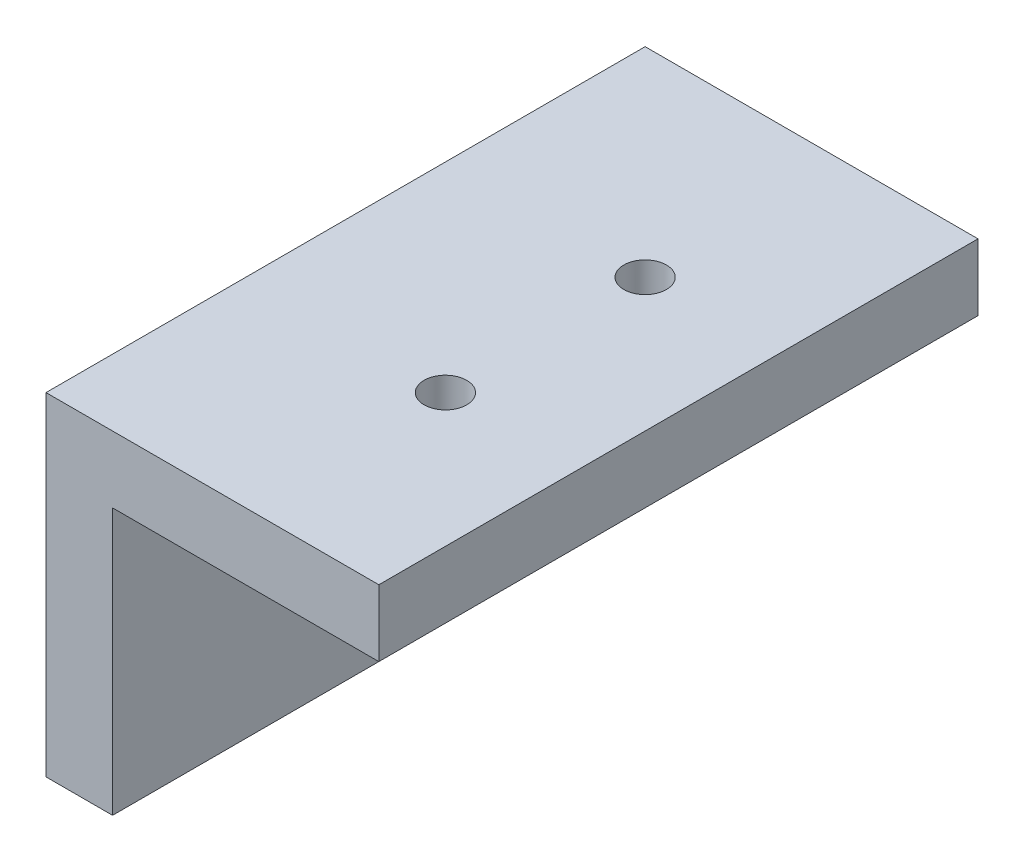
ISO-10303-21;
HEADER;
FILE_DESCRIPTION(('STEP AP214'),'2;1');
FILE_NAME('part.step','',(''),(''),'','','');
FILE_SCHEMA(('AUTOMOTIVE_DESIGN { 1 0 10303 214 1 1 1 1 }'));
ENDSEC;
DATA;
#1=APPLICATION_CONTEXT('core data for automotive mechanical design processes');
#2=APPLICATION_PROTOCOL_DEFINITION('international standard','automotive_design',2000,#1);
#3=PRODUCT_CONTEXT('',#1,'mechanical');
#4=PRODUCT('Part','Part','',(#3));
#5=PRODUCT_RELATED_PRODUCT_CATEGORY('part','',(#4));
#6=PRODUCT_DEFINITION_FORMATION('','',#4);
#7=PRODUCT_DEFINITION_CONTEXT('part definition',#1,'design');
#8=PRODUCT_DEFINITION('design','',#6,#7);
#9=PRODUCT_DEFINITION_SHAPE('','',#8);
#10=(LENGTH_UNIT() NAMED_UNIT(*) SI_UNIT(.MILLI.,.METRE.));
#11=(NAMED_UNIT(*) PLANE_ANGLE_UNIT() SI_UNIT($,.RADIAN.));
#12=(NAMED_UNIT(*) SI_UNIT($,.STERADIAN.) SOLID_ANGLE_UNIT());
#13=UNCERTAINTY_MEASURE_WITH_UNIT(LENGTH_MEASURE(1.E-05),#10,'distance_accuracy_value','');
#14=(GEOMETRIC_REPRESENTATION_CONTEXT(3) GLOBAL_UNCERTAINTY_ASSIGNED_CONTEXT((#13)) GLOBAL_UNIT_ASSIGNED_CONTEXT((#10,
#11,#12)) REPRESENTATION_CONTEXT('',''));
#15=CARTESIAN_POINT('',(0.,0.,0.));
#16=DIRECTION('',(0.,0.,1.));
#17=DIRECTION('',(1.,0.,0.));
#18=AXIS2_PLACEMENT_3D('',#15,#16,#17);
#19=CARTESIAN_POINT('',(-5.001,-10.,15.));
#20=DIRECTION('',(1.,0.,0.));
#21=DIRECTION('',(0.,1.,0.));
#22=AXIS2_PLACEMENT_3D('',#19,#20,#21);
#23=CYLINDRICAL_SURFACE('',#22,1.6);
#24=CARTESIAN_POINT('',(-5.,-10.,15.));
#25=DIRECTION('',(1.,0.,0.));
#26=DIRECTION('',(0.,1.,0.));
#27=AXIS2_PLACEMENT_3D('',#24,#25,#26);
#28=CIRCLE('',#27,1.6);
#29=CARTESIAN_POINT('',(-5.,-8.4,15.));
#30=VERTEX_POINT('',#29);
#31=EDGE_CURVE('E170',#30,#30,#28,.F.);
#32=ORIENTED_EDGE('',*,*,#31,.T.);
#33=EDGE_LOOP('',(#32));
#34=FACE_BOUND('',#33,.T.);
#35=CARTESIAN_POINT('',(-3.75,-10.,15.));
#36=DIRECTION('',(1.,0.,0.));
#37=DIRECTION('',(0.,1.,0.));
#38=AXIS2_PLACEMENT_3D('',#35,#36,#37);
#39=CIRCLE('',#38,1.6);
#40=CARTESIAN_POINT('',(-3.75,-8.4,15.));
#41=VERTEX_POINT('',#40);
#42=EDGE_CURVE('E37',#41,#41,#39,.F.);
#43=ORIENTED_EDGE('',*,*,#42,.F.);
#44=EDGE_LOOP('',(#43));
#45=FACE_BOUND('',#44,.T.);
#46=ADVANCED_FACE('F33',(#34,#45),#23,.F.);
#47=CARTESIAN_POINT('',(-5.001,-10.,30.));
#48=DIRECTION('',(1.,0.,0.));
#49=DIRECTION('',(0.,1.,0.));
#50=AXIS2_PLACEMENT_3D('',#47,#48,#49);
#51=CYLINDRICAL_SURFACE('',#50,1.6);
#52=CARTESIAN_POINT('',(-5.,-10.,30.));
#53=DIRECTION('',(1.,0.,0.));
#54=DIRECTION('',(0.,1.,0.));
#55=AXIS2_PLACEMENT_3D('',#52,#53,#54);
#56=CIRCLE('',#55,1.6);
#57=CARTESIAN_POINT('',(-5.,-8.4,30.));
#58=VERTEX_POINT('',#57);
#59=EDGE_CURVE('E128',#58,#58,#56,.F.);
#60=ORIENTED_EDGE('',*,*,#59,.T.);
#61=EDGE_LOOP('',(#60));
#62=FACE_BOUND('',#61,.T.);
#63=CARTESIAN_POINT('',(-3.75,-10.,30.));
#64=DIRECTION('',(1.,0.,0.));
#65=DIRECTION('',(0.,1.,0.));
#66=AXIS2_PLACEMENT_3D('',#63,#64,#65);
#67=CIRCLE('',#66,1.6);
#68=CARTESIAN_POINT('',(-3.75,-8.4,30.));
#69=VERTEX_POINT('',#68);
#70=EDGE_CURVE('E144',#69,#69,#67,.F.);
#71=ORIENTED_EDGE('',*,*,#70,.F.);
#72=EDGE_LOOP('',(#71));
#73=FACE_BOUND('',#72,.T.);
#74=ADVANCED_FACE('F205',(#62,#73),#51,.F.);
#75=CARTESIAN_POINT('',(0.,0.,45.));
#76=DIRECTION('',(0.,1.,0.));
#77=DIRECTION('',(0.,0.,1.));
#78=AXIS2_PLACEMENT_3D('',#75,#76,#77);
#79=PLANE('',#78);
#80=CARTESIAN_POINT('',(10.,0.,30.));
#81=DIRECTION('',(0.,-1.,0.));
#82=DIRECTION('',(0.,0.,-1.));
#83=AXIS2_PLACEMENT_3D('',#80,#81,#82);
#84=CIRCLE('',#83,1.6);
#85=CARTESIAN_POINT('',(10.,0.,28.4));
#86=VERTEX_POINT('',#85);
#87=EDGE_CURVE('E161',#86,#86,#84,.T.);
#88=ORIENTED_EDGE('',*,*,#87,.F.);
#89=EDGE_LOOP('',(#88));
#90=FACE_BOUND('',#89,.T.);
#91=CARTESIAN_POINT('',(10.,0.,15.));
#92=DIRECTION('',(0.,-1.,0.));
#93=DIRECTION('',(0.,0.,-1.));
#94=AXIS2_PLACEMENT_3D('',#91,#92,#93);
#95=CIRCLE('',#94,1.6);
#96=CARTESIAN_POINT('',(10.,0.,13.4));
#97=VERTEX_POINT('',#96);
#98=EDGE_CURVE('E152',#97,#97,#95,.T.);
#99=ORIENTED_EDGE('',*,*,#98,.F.);
#100=EDGE_LOOP('',(#99));
#101=FACE_BOUND('',#100,.T.);
#102=DIRECTION('',(1.,0.,0.));
#103=VECTOR('',#102,1.);
#104=CARTESIAN_POINT('',(0.,0.,0.));
#105=LINE('',#104,#103);
#106=CARTESIAN_POINT('',(0.,0.,0.));
#107=VERTEX_POINT('',#106);
#108=CARTESIAN_POINT('',(20.,0.,0.));
#109=VERTEX_POINT('',#108);
#110=EDGE_CURVE('E124',#107,#109,#105,.T.);
#111=ORIENTED_EDGE('',*,*,#110,.T.);
#112=DIRECTION('',(0.,0.,-1.));
#113=VECTOR('',#112,1.);
#114=CARTESIAN_POINT('',(20.,0.,45.));
#115=LINE('',#114,#113);
#116=CARTESIAN_POINT('',(20.,0.,45.));
#117=VERTEX_POINT('',#116);
#118=EDGE_CURVE('E11',#117,#109,#115,.T.);
#119=ORIENTED_EDGE('',*,*,#118,.F.);
#120=DIRECTION('',(1.,0.,0.));
#121=VECTOR('',#120,1.);
#122=CARTESIAN_POINT('',(0.,0.,45.));
#123=LINE('',#122,#121);
#124=CARTESIAN_POINT('',(0.,0.,45.));
#125=VERTEX_POINT('',#124);
#126=EDGE_CURVE('E135',#125,#117,#123,.T.);
#127=ORIENTED_EDGE('',*,*,#126,.F.);
#128=DIRECTION('',(0.,0.,-1.));
#129=VECTOR('',#128,1.);
#130=CARTESIAN_POINT('',(0.,0.,45.));
#131=LINE('',#130,#129);
#132=EDGE_CURVE('E120',#125,#107,#131,.T.);
#133=ORIENTED_EDGE('',*,*,#132,.T.);
#134=EDGE_LOOP('',(#111,#119,#127,#133));
#135=FACE_BOUND('',#134,.T.);
#136=ADVANCED_FACE('F35',(#90,#101,#135),#79,.F.);
#137=CARTESIAN_POINT('',(20.,0.,45.));
#138=DIRECTION('',(-1.,0.,0.));
#139=DIRECTION('',(0.,0.,1.));
#140=AXIS2_PLACEMENT_3D('',#137,#138,#139);
#141=PLANE('',#140);
#142=DIRECTION('',(0.,1.,0.));
#143=VECTOR('',#142,1.);
#144=CARTESIAN_POINT('',(20.,0.,0.));
#145=LINE('',#144,#143);
#146=CARTESIAN_POINT('',(20.,5.,0.));
#147=VERTEX_POINT('',#146);
#148=EDGE_CURVE('E127',#109,#147,#145,.T.);
#149=ORIENTED_EDGE('',*,*,#148,.T.);
#150=DIRECTION('',(0.,0.,-1.));
#151=VECTOR('',#150,1.);
#152=CARTESIAN_POINT('',(20.,5.,45.));
#153=LINE('',#152,#151);
#154=CARTESIAN_POINT('',(20.,5.,45.));
#155=VERTEX_POINT('',#154);
#156=EDGE_CURVE('E43',#155,#147,#153,.T.);
#157=ORIENTED_EDGE('',*,*,#156,.F.);
#158=DIRECTION('',(0.,1.,0.));
#159=VECTOR('',#158,1.);
#160=CARTESIAN_POINT('',(20.,0.,45.));
#161=LINE('',#160,#159);
#162=EDGE_CURVE('E90',#117,#155,#161,.T.);
#163=ORIENTED_EDGE('',*,*,#162,.F.);
#164=ORIENTED_EDGE('',*,*,#118,.T.);
#165=EDGE_LOOP('',(#149,#157,#163,#164));
#166=FACE_BOUND('',#165,.T.);
#167=ADVANCED_FACE('F181',(#166),#141,.F.);
#168=CARTESIAN_POINT('',(20.,5.,45.));
#169=DIRECTION('',(0.,-1.,0.));
#170=DIRECTION('',(1.,0.,0.));
#171=AXIS2_PLACEMENT_3D('',#168,#169,#170);
#172=PLANE('',#171);
#173=CARTESIAN_POINT('',(10.,5.,30.));
#174=DIRECTION('',(0.,-1.,0.));
#175=DIRECTION('',(1.,0.,0.));
#176=AXIS2_PLACEMENT_3D('',#173,#174,#175);
#177=CIRCLE('',#176,1.6);
#178=CARTESIAN_POINT('',(11.6,5.,30.));
#179=VERTEX_POINT('',#178);
#180=EDGE_CURVE('E164',#179,#179,#177,.F.);
#181=ORIENTED_EDGE('',*,*,#180,.F.);
#182=EDGE_LOOP('',(#181));
#183=FACE_BOUND('',#182,.T.);
#184=CARTESIAN_POINT('',(10.,5.,15.));
#185=DIRECTION('',(0.,-1.,0.));
#186=DIRECTION('',(1.,0.,0.));
#187=AXIS2_PLACEMENT_3D('',#184,#185,#186);
#188=CIRCLE('',#187,1.6);
#189=CARTESIAN_POINT('',(11.6,5.,15.));
#190=VERTEX_POINT('',#189);
#191=EDGE_CURVE('E156',#190,#190,#188,.F.);
#192=ORIENTED_EDGE('',*,*,#191,.F.);
#193=EDGE_LOOP('',(#192));
#194=FACE_BOUND('',#193,.T.);
#195=DIRECTION('',(-1.,0.,0.));
#196=VECTOR('',#195,1.);
#197=CARTESIAN_POINT('',(20.,5.,0.));
#198=LINE('',#197,#196);
#199=CARTESIAN_POINT('',(-5.,5.,0.));
#200=VERTEX_POINT('',#199);
#201=EDGE_CURVE('E130',#147,#200,#198,.T.);
#202=ORIENTED_EDGE('',*,*,#201,.T.);
#203=DIRECTION('',(0.,0.,-1.));
#204=VECTOR('',#203,1.);
#205=CARTESIAN_POINT('',(-5.,5.,45.));
#206=LINE('',#205,#204);
#207=CARTESIAN_POINT('',(-5.,5.,45.));
#208=VERTEX_POINT('',#207);
#209=EDGE_CURVE('E115',#208,#200,#206,.T.);
#210=ORIENTED_EDGE('',*,*,#209,.F.);
#211=DIRECTION('',(-1.,0.,0.));
#212=VECTOR('',#211,1.);
#213=CARTESIAN_POINT('',(20.,5.,45.));
#214=LINE('',#213,#212);
#215=EDGE_CURVE('E106',#155,#208,#214,.T.);
#216=ORIENTED_EDGE('',*,*,#215,.F.);
#217=ORIENTED_EDGE('',*,*,#156,.T.);
#218=EDGE_LOOP('',(#202,#210,#216,#217));
#219=FACE_BOUND('',#218,.T.);
#220=ADVANCED_FACE('F184',(#183,#194,#219),#172,.F.);
#221=CARTESIAN_POINT('',(-5.,5.,45.));
#222=DIRECTION('',(1.,0.,0.));
#223=DIRECTION('',(0.,1.,0.));
#224=AXIS2_PLACEMENT_3D('',#221,#222,#223);
#225=PLANE('',#224);
#226=ORIENTED_EDGE('',*,*,#59,.F.);
#227=EDGE_LOOP('',(#226));
#228=FACE_BOUND('',#227,.T.);
#229=ORIENTED_EDGE('',*,*,#31,.F.);
#230=EDGE_LOOP('',(#229));
#231=FACE_BOUND('',#230,.T.);
#232=DIRECTION('',(0.,-1.,0.));
#233=VECTOR('',#232,1.);
#234=CARTESIAN_POINT('',(-5.,5.,0.));
#235=LINE('',#234,#233);
#236=CARTESIAN_POINT('',(-5.,-20.,0.));
#237=VERTEX_POINT('',#236);
#238=EDGE_CURVE('E114',#200,#237,#235,.T.);
#239=ORIENTED_EDGE('',*,*,#238,.T.);
#240=DIRECTION('',(0.,0.,-1.));
#241=VECTOR('',#240,1.);
#242=CARTESIAN_POINT('',(-5.,-20.,45.));
#243=LINE('',#242,#241);
#244=CARTESIAN_POINT('',(-5.,-20.,45.));
#245=VERTEX_POINT('',#244);
#246=EDGE_CURVE('E111',#245,#237,#243,.T.);
#247=ORIENTED_EDGE('',*,*,#246,.F.);
#248=DIRECTION('',(0.,-1.,0.));
#249=VECTOR('',#248,1.);
#250=CARTESIAN_POINT('',(-5.,5.,45.));
#251=LINE('',#250,#249);
#252=EDGE_CURVE('E100',#208,#245,#251,.T.);
#253=ORIENTED_EDGE('',*,*,#252,.F.);
#254=ORIENTED_EDGE('',*,*,#209,.T.);
#255=EDGE_LOOP('',(#239,#247,#253,#254));
#256=FACE_BOUND('',#255,.T.);
#257=ADVANCED_FACE('F112',(#228,#231,#256),#225,.F.);
#258=CARTESIAN_POINT('',(-5.,-20.,45.));
#259=DIRECTION('',(0.,1.,0.));
#260=DIRECTION('',(-1.,0.,0.));
#261=AXIS2_PLACEMENT_3D('',#258,#259,#260);
#262=PLANE('',#261);
#263=DIRECTION('',(1.,0.,0.));
#264=VECTOR('',#263,1.);
#265=CARTESIAN_POINT('',(-5.,-20.,0.));
#266=LINE('',#265,#264);
#267=CARTESIAN_POINT('',(0.,-20.,0.));
#268=VERTEX_POINT('',#267);
#269=EDGE_CURVE('E76',#237,#268,#266,.T.);
#270=ORIENTED_EDGE('',*,*,#269,.T.);
#271=DIRECTION('',(0.,0.,-1.));
#272=VECTOR('',#271,1.);
#273=CARTESIAN_POINT('',(0.,-20.,45.));
#274=LINE('',#273,#272);
#275=CARTESIAN_POINT('',(0.,-20.,45.));
#276=VERTEX_POINT('',#275);
#277=EDGE_CURVE('E116',#276,#268,#274,.T.);
#278=ORIENTED_EDGE('',*,*,#277,.F.);
#279=DIRECTION('',(1.,0.,0.));
#280=VECTOR('',#279,1.);
#281=CARTESIAN_POINT('',(-5.,-20.,45.));
#282=LINE('',#281,#280);
#283=EDGE_CURVE('E104',#245,#276,#282,.T.);
#284=ORIENTED_EDGE('',*,*,#283,.F.);
#285=ORIENTED_EDGE('',*,*,#246,.T.);
#286=EDGE_LOOP('',(#270,#278,#284,#285));
#287=FACE_BOUND('',#286,.T.);
#288=ADVANCED_FACE('F118',(#287),#262,.F.);
#289=CARTESIAN_POINT('',(0.,0.,45.));
#290=DIRECTION('',(-1.,0.,0.));
#291=DIRECTION('',(0.,-1.,0.));
#292=AXIS2_PLACEMENT_3D('',#289,#290,#291);
#293=PLANE('',#292);
#294=CARTESIAN_POINT('',(0.,-10.,30.));
#295=DIRECTION('',(1.,0.,0.));
#296=DIRECTION('',(0.,1.,0.));
#297=AXIS2_PLACEMENT_3D('',#294,#295,#296);
#298=CIRCLE('',#297,1.6);
#299=CARTESIAN_POINT('',(0.,-8.4,30.));
#300=VERTEX_POINT('',#299);
#301=EDGE_CURVE('E167',#300,#300,#298,.T.);
#302=ORIENTED_EDGE('',*,*,#301,.F.);
#303=EDGE_LOOP('',(#302));
#304=FACE_BOUND('',#303,.T.);
#305=CARTESIAN_POINT('',(0.,-10.,15.));
#306=DIRECTION('',(1.,0.,0.));
#307=DIRECTION('',(0.,1.,0.));
#308=AXIS2_PLACEMENT_3D('',#305,#306,#307);
#309=CIRCLE('',#308,1.6);
#310=CARTESIAN_POINT('',(0.,-8.4,15.));
#311=VERTEX_POINT('',#310);
#312=EDGE_CURVE('E173',#311,#311,#309,.T.);
#313=ORIENTED_EDGE('',*,*,#312,.F.);
#314=EDGE_LOOP('',(#313));
#315=FACE_BOUND('',#314,.T.);
#316=DIRECTION('',(0.,1.,0.));
#317=VECTOR('',#316,1.);
#318=CARTESIAN_POINT('',(0.,0.,0.));
#319=LINE('',#318,#317);
#320=EDGE_CURVE('E82',#268,#107,#319,.T.);
#321=ORIENTED_EDGE('',*,*,#320,.T.);
#322=ORIENTED_EDGE('',*,*,#132,.F.);
#323=DIRECTION('',(0.,1.,0.));
#324=VECTOR('',#323,1.);
#325=CARTESIAN_POINT('',(0.,0.,45.));
#326=LINE('',#325,#324);
#327=EDGE_CURVE('E52',#276,#125,#326,.T.);
#328=ORIENTED_EDGE('',*,*,#327,.F.);
#329=ORIENTED_EDGE('',*,*,#277,.T.);
#330=EDGE_LOOP('',(#321,#322,#328,#329));
#331=FACE_BOUND('',#330,.T.);
#332=ADVANCED_FACE('F189',(#304,#315,#331),#293,.F.);
#333=CARTESIAN_POINT('',(0.,0.,45.));
#334=DIRECTION('',(0.,0.,1.));
#335=DIRECTION('',(1.,0.,0.));
#336=AXIS2_PLACEMENT_3D('',#333,#334,#335);
#337=PLANE('',#336);
#338=ORIENTED_EDGE('',*,*,#126,.T.);
#339=ORIENTED_EDGE('',*,*,#162,.T.);
#340=ORIENTED_EDGE('',*,*,#215,.T.);
#341=ORIENTED_EDGE('',*,*,#252,.T.);
#342=ORIENTED_EDGE('',*,*,#283,.T.);
#343=ORIENTED_EDGE('',*,*,#327,.T.);
#344=EDGE_LOOP('',(#338,#339,#340,#341,#342,#343));
#345=FACE_BOUND('',#344,.T.);
#346=ADVANCED_FACE('F102',(#345),#337,.T.);
#347=CARTESIAN_POINT('',(0.,0.,0.));
#348=DIRECTION('',(0.,0.,1.));
#349=DIRECTION('',(1.,0.,0.));
#350=AXIS2_PLACEMENT_3D('',#347,#348,#349);
#351=PLANE('',#350);
#352=ORIENTED_EDGE('',*,*,#110,.F.);
#353=ORIENTED_EDGE('',*,*,#320,.F.);
#354=ORIENTED_EDGE('',*,*,#269,.F.);
#355=ORIENTED_EDGE('',*,*,#238,.F.);
#356=ORIENTED_EDGE('',*,*,#201,.F.);
#357=ORIENTED_EDGE('',*,*,#148,.F.);
#358=EDGE_LOOP('',(#352,#353,#354,#355,#356,#357));
#359=FACE_BOUND('',#358,.T.);
#360=ADVANCED_FACE('F187',(#359),#351,.F.);
#361=CARTESIAN_POINT('',(-1.25,-10.,15.));
#362=DIRECTION('',(1.,0.,0.));
#363=DIRECTION('',(0.,1.,0.));
#364=AXIS2_PLACEMENT_3D('',#361,#362,#363);
#365=CIRCLE('',#364,1.6);
#366=CARTESIAN_POINT('',(-1.25,-8.4,15.));
#367=VERTEX_POINT('',#366);
#368=EDGE_CURVE('E147',#367,#367,#365,.F.);
#369=ORIENTED_EDGE('',*,*,#368,.T.);
#370=EDGE_LOOP('',(#369));
#371=FACE_BOUND('',#370,.T.);
#372=ORIENTED_EDGE('',*,*,#312,.T.);
#373=EDGE_LOOP('',(#372));
#374=FACE_BOUND('',#373,.T.);
#375=ADVANCED_FACE('F208',(#371,#374),#23,.F.);
#376=CARTESIAN_POINT('',(-1.25,-10.,30.));
#377=DIRECTION('',(1.,0.,0.));
#378=DIRECTION('',(0.,1.,0.));
#379=AXIS2_PLACEMENT_3D('',#376,#377,#378);
#380=CIRCLE('',#379,1.6);
#381=CARTESIAN_POINT('',(-1.25,-8.4,30.));
#382=VERTEX_POINT('',#381);
#383=EDGE_CURVE('E141',#382,#382,#380,.F.);
#384=ORIENTED_EDGE('',*,*,#383,.T.);
#385=EDGE_LOOP('',(#384));
#386=FACE_BOUND('',#385,.T.);
#387=ORIENTED_EDGE('',*,*,#301,.T.);
#388=EDGE_LOOP('',(#387));
#389=FACE_BOUND('',#388,.T.);
#390=ADVANCED_FACE('F215',(#386,#389),#51,.F.);
#391=CARTESIAN_POINT('',(10.,5.001,15.));
#392=DIRECTION('',(0.,-1.,0.));
#393=DIRECTION('',(0.,0.,-1.));
#394=AXIS2_PLACEMENT_3D('',#391,#392,#393);
#395=CYLINDRICAL_SURFACE('',#394,1.6);
#396=ORIENTED_EDGE('',*,*,#98,.T.);
#397=EDGE_LOOP('',(#396));
#398=FACE_BOUND('',#397,.T.);
#399=ORIENTED_EDGE('',*,*,#191,.T.);
#400=EDGE_LOOP('',(#399));
#401=FACE_BOUND('',#400,.T.);
#402=ADVANCED_FACE('F221',(#398,#401),#395,.F.);
#403=CARTESIAN_POINT('',(10.,5.001,30.));
#404=DIRECTION('',(0.,-1.,0.));
#405=DIRECTION('',(0.,0.,-1.));
#406=AXIS2_PLACEMENT_3D('',#403,#404,#405);
#407=CYLINDRICAL_SURFACE('',#406,1.6);
#408=ORIENTED_EDGE('',*,*,#87,.T.);
#409=EDGE_LOOP('',(#408));
#410=FACE_BOUND('',#409,.T.);
#411=ORIENTED_EDGE('',*,*,#180,.T.);
#412=EDGE_LOOP('',(#411));
#413=FACE_BOUND('',#412,.T.);
#414=ADVANCED_FACE('F248',(#410,#413),#407,.F.);
#415=CARTESIAN_POINT('',(-3.75,0.,0.));
#416=DIRECTION('',(1.,0.,0.));
#417=DIRECTION('',(0.,1.,0.));
#418=AXIS2_PLACEMENT_3D('',#415,#416,#417);
#419=PLANE('',#418);
#420=DIRECTION('',(0.,0.5,0.866025403784439));
#421=VECTOR('',#420,1.);
#422=CARTESIAN_POINT('',(-3.75,-8.28238294916086,27.025));
#423=LINE('',#422,#421);
#424=CARTESIAN_POINT('',(-3.75,-8.28238294916086,27.025));
#425=VERTEX_POINT('',#424);
#426=CARTESIAN_POINT('',(-3.75,-6.56476589832173,30.));
#427=VERTEX_POINT('',#426);
#428=EDGE_CURVE('E578',#425,#427,#423,.T.);
#429=ORIENTED_EDGE('',*,*,#428,.T.);
#430=DIRECTION('',(0.,-0.5,0.866025403784439));
#431=VECTOR('',#430,1.);
#432=CARTESIAN_POINT('',(-3.75,-6.56476589832173,30.));
#433=LINE('',#432,#431);
#434=CARTESIAN_POINT('',(-3.75,-8.28238294916086,32.975));
#435=VERTEX_POINT('',#434);
#436=EDGE_CURVE('E604',#427,#435,#433,.T.);
#437=ORIENTED_EDGE('',*,*,#436,.T.);
#438=DIRECTION('',(0.,-1.,0.));
#439=VECTOR('',#438,1.);
#440=CARTESIAN_POINT('',(-3.75,-8.28238294916086,32.975));
#441=LINE('',#440,#439);
#442=CARTESIAN_POINT('',(-3.75,-11.7176170508391,32.975));
#443=VERTEX_POINT('',#442);
#444=EDGE_CURVE('E601',#435,#443,#441,.T.);
#445=ORIENTED_EDGE('',*,*,#444,.T.);
#446=DIRECTION('',(0.,-0.5,-0.866025403784439));
#447=VECTOR('',#446,1.);
#448=CARTESIAN_POINT('',(-3.75,-11.7176170508391,32.975));
#449=LINE('',#448,#447);
#450=CARTESIAN_POINT('',(-3.75,-13.4352341016783,30.));
#451=VERTEX_POINT('',#450);
#452=EDGE_CURVE('E598',#443,#451,#449,.T.);
#453=ORIENTED_EDGE('',*,*,#452,.T.);
#454=DIRECTION('',(0.,0.5,-0.866025403784438));
#455=VECTOR('',#454,1.);
#456=CARTESIAN_POINT('',(-3.75,-13.4352341016783,30.));
#457=LINE('',#456,#455);
#458=CARTESIAN_POINT('',(-3.75,-11.7176170508391,27.025));
#459=VERTEX_POINT('',#458);
#460=EDGE_CURVE('E595',#451,#459,#457,.T.);
#461=ORIENTED_EDGE('',*,*,#460,.T.);
#462=DIRECTION('',(0.,1.,0.));
#463=VECTOR('',#462,1.);
#464=CARTESIAN_POINT('',(-3.75,-11.7176170508391,27.025));
#465=LINE('',#464,#463);
#466=EDGE_CURVE('E561',#459,#425,#465,.T.);
#467=ORIENTED_EDGE('',*,*,#466,.T.);
#468=EDGE_LOOP('',(#429,#437,#445,#453,#461,#467));
#469=FACE_BOUND('',#468,.T.);
#470=ORIENTED_EDGE('',*,*,#70,.T.);
#471=EDGE_LOOP('',(#470));
#472=FACE_BOUND('',#471,.T.);
#473=ADVANCED_FACE('F254',(#469,#472),#419,.T.);
#474=CARTESIAN_POINT('',(-1.25,0.,0.));
#475=DIRECTION('',(1.,0.,0.));
#476=DIRECTION('',(0.,1.,0.));
#477=AXIS2_PLACEMENT_3D('',#474,#475,#476);
#478=PLANE('',#477);
#479=DIRECTION('',(0.,0.5,0.866025403784439));
#480=VECTOR('',#479,1.);
#481=CARTESIAN_POINT('',(-1.25,-8.28238294916086,27.025));
#482=LINE('',#481,#480);
#483=CARTESIAN_POINT('',(-1.25,-8.28238294916086,27.025));
#484=VERTEX_POINT('',#483);
#485=CARTESIAN_POINT('',(-1.25,-6.56476589832173,30.));
#486=VERTEX_POINT('',#485);
#487=EDGE_CURVE('E466',#484,#486,#482,.T.);
#488=ORIENTED_EDGE('',*,*,#487,.F.);
#489=DIRECTION('',(0.,1.,0.));
#490=VECTOR('',#489,1.);
#491=CARTESIAN_POINT('',(-1.25,-11.7176170508391,27.025));
#492=LINE('',#491,#490);
#493=CARTESIAN_POINT('',(-1.25,-11.7176170508391,27.025));
#494=VERTEX_POINT('',#493);
#495=EDGE_CURVE('E575',#494,#484,#492,.T.);
#496=ORIENTED_EDGE('',*,*,#495,.F.);
#497=DIRECTION('',(0.,0.5,-0.866025403784438));
#498=VECTOR('',#497,1.);
#499=CARTESIAN_POINT('',(-1.25,-13.4352341016783,30.));
#500=LINE('',#499,#498);
#501=CARTESIAN_POINT('',(-1.25,-13.4352341016783,30.));
#502=VERTEX_POINT('',#501);
#503=EDGE_CURVE('E579',#502,#494,#500,.T.);
#504=ORIENTED_EDGE('',*,*,#503,.F.);
#505=DIRECTION('',(0.,-0.5,-0.866025403784439));
#506=VECTOR('',#505,1.);
#507=CARTESIAN_POINT('',(-1.25,-11.7176170508391,32.975));
#508=LINE('',#507,#506);
#509=CARTESIAN_POINT('',(-1.25,-11.7176170508391,32.975));
#510=VERTEX_POINT('',#509);
#511=EDGE_CURVE('E582',#510,#502,#508,.T.);
#512=ORIENTED_EDGE('',*,*,#511,.F.);
#513=DIRECTION('',(0.,-1.,0.));
#514=VECTOR('',#513,1.);
#515=CARTESIAN_POINT('',(-1.25,-8.28238294916086,32.975));
#516=LINE('',#515,#514);
#517=CARTESIAN_POINT('',(-1.25,-8.28238294916086,32.975));
#518=VERTEX_POINT('',#517);
#519=EDGE_CURVE('E585',#518,#510,#516,.T.);
#520=ORIENTED_EDGE('',*,*,#519,.F.);
#521=DIRECTION('',(0.,-0.5,0.866025403784439));
#522=VECTOR('',#521,1.);
#523=CARTESIAN_POINT('',(-1.25,-6.56476589832173,30.));
#524=LINE('',#523,#522);
#525=EDGE_CURVE('E588',#486,#518,#524,.T.);
#526=ORIENTED_EDGE('',*,*,#525,.F.);
#527=EDGE_LOOP('',(#488,#496,#504,#512,#520,#526));
#528=FACE_BOUND('',#527,.T.);
#529=ORIENTED_EDGE('',*,*,#383,.F.);
#530=EDGE_LOOP('',(#529));
#531=FACE_BOUND('',#530,.T.);
#532=ADVANCED_FACE('F272',(#528,#531),#478,.F.);
#533=CARTESIAN_POINT('',(-3.75,-8.28238294916086,27.025));
#534=DIRECTION('',(0.,0.866025403784439,-0.5));
#535=DIRECTION('',(0.,0.5,0.866025403784439));
#536=AXIS2_PLACEMENT_3D('',#533,#534,#535);
#537=PLANE('',#536);
#538=ORIENTED_EDGE('',*,*,#487,.T.);
#539=DIRECTION('',(1.,0.,0.));
#540=VECTOR('',#539,1.);
#541=CARTESIAN_POINT('',(-3.75,-6.56476589832173,30.));
#542=LINE('',#541,#540);
#543=EDGE_CURVE('E557',#427,#486,#542,.T.);
#544=ORIENTED_EDGE('',*,*,#543,.F.);
#545=ORIENTED_EDGE('',*,*,#428,.F.);
#546=DIRECTION('',(1.,0.,0.));
#547=VECTOR('',#546,1.);
#548=CARTESIAN_POINT('',(-3.75,-8.28238294916086,27.025));
#549=LINE('',#548,#547);
#550=EDGE_CURVE('E145',#425,#484,#549,.T.);
#551=ORIENTED_EDGE('',*,*,#550,.T.);
#552=EDGE_LOOP('',(#538,#544,#545,#551));
#553=FACE_BOUND('',#552,.T.);
#554=ADVANCED_FACE('F279',(#553),#537,.F.);
#555=CARTESIAN_POINT('',(-3.75,-11.7176170508391,27.025));
#556=DIRECTION('',(0.,0.,-1.));
#557=DIRECTION('',(-1.,0.,0.));
#558=AXIS2_PLACEMENT_3D('',#555,#556,#557);
#559=PLANE('',#558);
#560=ORIENTED_EDGE('',*,*,#495,.T.);
#561=ORIENTED_EDGE('',*,*,#550,.F.);
#562=ORIENTED_EDGE('',*,*,#466,.F.);
#563=DIRECTION('',(1.,0.,0.));
#564=VECTOR('',#563,1.);
#565=CARTESIAN_POINT('',(-3.75,-11.7176170508391,27.025));
#566=LINE('',#565,#564);
#567=EDGE_CURVE('E570',#459,#494,#566,.T.);
#568=ORIENTED_EDGE('',*,*,#567,.T.);
#569=EDGE_LOOP('',(#560,#561,#562,#568));
#570=FACE_BOUND('',#569,.T.);
#571=ADVANCED_FACE('F287',(#570),#559,.F.);
#572=CARTESIAN_POINT('',(-3.75,-13.4352341016783,30.));
#573=DIRECTION('',(0.,-0.866025403784438,-0.5));
#574=DIRECTION('',(0.,0.5,-0.866025403784438));
#575=AXIS2_PLACEMENT_3D('',#572,#573,#574);
#576=PLANE('',#575);
#577=ORIENTED_EDGE('',*,*,#503,.T.);
#578=ORIENTED_EDGE('',*,*,#567,.F.);
#579=ORIENTED_EDGE('',*,*,#460,.F.);
#580=DIRECTION('',(1.,0.,0.));
#581=VECTOR('',#580,1.);
#582=CARTESIAN_POINT('',(-3.75,-13.4352341016783,30.));
#583=LINE('',#582,#581);
#584=EDGE_CURVE('E567',#451,#502,#583,.T.);
#585=ORIENTED_EDGE('',*,*,#584,.T.);
#586=EDGE_LOOP('',(#577,#578,#579,#585));
#587=FACE_BOUND('',#586,.T.);
#588=ADVANCED_FACE('F295',(#587),#576,.F.);
#589=CARTESIAN_POINT('',(-3.75,-11.7176170508391,32.975));
#590=DIRECTION('',(0.,-0.866025403784439,0.5));
#591=DIRECTION('',(0.,-0.5,-0.866025403784439));
#592=AXIS2_PLACEMENT_3D('',#589,#590,#591);
#593=PLANE('',#592);
#594=ORIENTED_EDGE('',*,*,#511,.T.);
#595=ORIENTED_EDGE('',*,*,#584,.F.);
#596=ORIENTED_EDGE('',*,*,#452,.F.);
#597=DIRECTION('',(1.,0.,0.));
#598=VECTOR('',#597,1.);
#599=CARTESIAN_POINT('',(-3.75,-11.7176170508391,32.975));
#600=LINE('',#599,#598);
#601=EDGE_CURVE('E564',#443,#510,#600,.T.);
#602=ORIENTED_EDGE('',*,*,#601,.T.);
#603=EDGE_LOOP('',(#594,#595,#596,#602));
#604=FACE_BOUND('',#603,.T.);
#605=ADVANCED_FACE('F303',(#604),#593,.F.);
#606=CARTESIAN_POINT('',(-3.75,-8.28238294916086,32.975));
#607=DIRECTION('',(0.,0.,1.));
#608=DIRECTION('',(1.,0.,0.));
#609=AXIS2_PLACEMENT_3D('',#606,#607,#608);
#610=PLANE('',#609);
#611=ORIENTED_EDGE('',*,*,#519,.T.);
#612=ORIENTED_EDGE('',*,*,#601,.F.);
#613=ORIENTED_EDGE('',*,*,#444,.F.);
#614=DIRECTION('',(1.,0.,0.));
#615=VECTOR('',#614,1.);
#616=CARTESIAN_POINT('',(-3.75,-8.28238294916086,32.975));
#617=LINE('',#616,#615);
#618=EDGE_CURVE('E560',#435,#518,#617,.T.);
#619=ORIENTED_EDGE('',*,*,#618,.T.);
#620=EDGE_LOOP('',(#611,#612,#613,#619));
#621=FACE_BOUND('',#620,.T.);
#622=ADVANCED_FACE('F311',(#621),#610,.F.);
#623=CARTESIAN_POINT('',(-3.75,-6.56476589832173,30.));
#624=DIRECTION('',(0.,0.866025403784439,0.5));
#625=DIRECTION('',(0.,-0.5,0.866025403784439));
#626=AXIS2_PLACEMENT_3D('',#623,#624,#625);
#627=PLANE('',#626);
#628=ORIENTED_EDGE('',*,*,#525,.T.);
#629=ORIENTED_EDGE('',*,*,#618,.F.);
#630=ORIENTED_EDGE('',*,*,#436,.F.);
#631=ORIENTED_EDGE('',*,*,#543,.T.);
#632=EDGE_LOOP('',(#628,#629,#630,#631));
#633=FACE_BOUND('',#632,.T.);
#634=ADVANCED_FACE('F319',(#633),#627,.F.);
#635=CARTESIAN_POINT('',(-3.75,0.,0.));
#636=DIRECTION('',(1.,0.,0.));
#637=DIRECTION('',(0.,1.,0.));
#638=AXIS2_PLACEMENT_3D('',#635,#636,#637);
#639=PLANE('',#638);
#640=DIRECTION('',(0.,0.5,0.866025403784439));
#641=VECTOR('',#640,1.);
#642=CARTESIAN_POINT('',(-3.75,-8.28238294916086,12.025));
#643=LINE('',#642,#641);
#644=CARTESIAN_POINT('',(-3.75,-8.28238294916086,12.025));
#645=VERTEX_POINT('',#644);
#646=CARTESIAN_POINT('',(-3.75,-6.56476589832173,15.));
#647=VERTEX_POINT('',#646);
#648=EDGE_CURVE('E462',#645,#647,#643,.T.);
#649=ORIENTED_EDGE('',*,*,#648,.T.);
#650=DIRECTION('',(0.,-0.5,0.866025403784438));
#651=VECTOR('',#650,1.);
#652=CARTESIAN_POINT('',(-3.75,-6.56476589832173,15.));
#653=LINE('',#652,#651);
#654=CARTESIAN_POINT('',(-3.75,-8.28238294916086,17.975));
#655=VERTEX_POINT('',#654);
#656=EDGE_CURVE('E553',#647,#655,#653,.T.);
#657=ORIENTED_EDGE('',*,*,#656,.T.);
#658=DIRECTION('',(0.,-1.,0.));
#659=VECTOR('',#658,1.);
#660=CARTESIAN_POINT('',(-3.75,-8.28238294916086,17.975));
#661=LINE('',#660,#659);
#662=CARTESIAN_POINT('',(-3.75,-11.7176170508391,17.975));
#663=VERTEX_POINT('',#662);
#664=EDGE_CURVE('E550',#655,#663,#661,.T.);
#665=ORIENTED_EDGE('',*,*,#664,.T.);
#666=DIRECTION('',(0.,-0.5,-0.866025403784439));
#667=VECTOR('',#666,1.);
#668=CARTESIAN_POINT('',(-3.75,-11.7176170508391,17.975));
#669=LINE('',#668,#667);
#670=CARTESIAN_POINT('',(-3.75,-13.4352341016783,15.));
#671=VERTEX_POINT('',#670);
#672=EDGE_CURVE('E545',#663,#671,#669,.T.);
#673=ORIENTED_EDGE('',*,*,#672,.T.);
#674=DIRECTION('',(0.,0.5,-0.866025403784439));
#675=VECTOR('',#674,1.);
#676=CARTESIAN_POINT('',(-3.75,-13.4352341016783,15.));
#677=LINE('',#676,#675);
#678=CARTESIAN_POINT('',(-3.75,-11.7176170508391,12.025));
#679=VERTEX_POINT('',#678);
#680=EDGE_CURVE('E540',#671,#679,#677,.T.);
#681=ORIENTED_EDGE('',*,*,#680,.T.);
#682=DIRECTION('',(0.,1.,0.));
#683=VECTOR('',#682,1.);
#684=CARTESIAN_POINT('',(-3.75,-11.7176170508391,12.025));
#685=LINE('',#684,#683);
#686=EDGE_CURVE('E477',#679,#645,#685,.T.);
#687=ORIENTED_EDGE('',*,*,#686,.T.);
#688=EDGE_LOOP('',(#649,#657,#665,#673,#681,#687));
#689=FACE_BOUND('',#688,.T.);
#690=ORIENTED_EDGE('',*,*,#42,.T.);
#691=EDGE_LOOP('',(#690));
#692=FACE_BOUND('',#691,.T.);
#693=ADVANCED_FACE('F327',(#689,#692),#639,.T.);
#694=CARTESIAN_POINT('',(-1.25,0.,0.));
#695=DIRECTION('',(1.,0.,0.));
#696=DIRECTION('',(0.,1.,0.));
#697=AXIS2_PLACEMENT_3D('',#694,#695,#696);
#698=PLANE('',#697);
#699=DIRECTION('',(0.,0.5,0.866025403784439));
#700=VECTOR('',#699,1.);
#701=CARTESIAN_POINT('',(-1.25,-8.28238294916086,12.025));
#702=LINE('',#701,#700);
#703=CARTESIAN_POINT('',(-1.25,-8.28238294916086,12.025));
#704=VERTEX_POINT('',#703);
#705=CARTESIAN_POINT('',(-1.25,-6.56476589832173,15.));
#706=VERTEX_POINT('',#705);
#707=EDGE_CURVE('E446',#704,#706,#702,.T.);
#708=ORIENTED_EDGE('',*,*,#707,.F.);
#709=DIRECTION('',(0.,1.,0.));
#710=VECTOR('',#709,1.);
#711=CARTESIAN_POINT('',(-1.25,-11.7176170508391,12.025));
#712=LINE('',#711,#710);
#713=CARTESIAN_POINT('',(-1.25,-11.7176170508391,12.025));
#714=VERTEX_POINT('',#713);
#715=EDGE_CURVE('E459',#714,#704,#712,.T.);
#716=ORIENTED_EDGE('',*,*,#715,.F.);
#717=DIRECTION('',(0.,0.5,-0.866025403784439));
#718=VECTOR('',#717,1.);
#719=CARTESIAN_POINT('',(-1.25,-13.4352341016783,15.));
#720=LINE('',#719,#718);
#721=CARTESIAN_POINT('',(-1.25,-13.4352341016783,15.));
#722=VERTEX_POINT('',#721);
#723=EDGE_CURVE('E456',#722,#714,#720,.T.);
#724=ORIENTED_EDGE('',*,*,#723,.F.);
#725=DIRECTION('',(0.,-0.5,-0.866025403784439));
#726=VECTOR('',#725,1.);
#727=CARTESIAN_POINT('',(-1.25,-11.7176170508391,17.975));
#728=LINE('',#727,#726);
#729=CARTESIAN_POINT('',(-1.25,-11.7176170508391,17.975));
#730=VERTEX_POINT('',#729);
#731=EDGE_CURVE('E449',#730,#722,#728,.T.);
#732=ORIENTED_EDGE('',*,*,#731,.F.);
#733=DIRECTION('',(0.,-1.,0.));
#734=VECTOR('',#733,1.);
#735=CARTESIAN_POINT('',(-1.25,-8.28238294916086,17.975));
#736=LINE('',#735,#734);
#737=CARTESIAN_POINT('',(-1.25,-8.28238294916086,17.975));
#738=VERTEX_POINT('',#737);
#739=EDGE_CURVE('E445',#738,#730,#736,.T.);
#740=ORIENTED_EDGE('',*,*,#739,.F.);
#741=DIRECTION('',(0.,-0.5,0.866025403784438));
#742=VECTOR('',#741,1.);
#743=CARTESIAN_POINT('',(-1.25,-6.56476589832173,15.));
#744=LINE('',#743,#742);
#745=EDGE_CURVE('E431',#706,#738,#744,.T.);
#746=ORIENTED_EDGE('',*,*,#745,.F.);
#747=EDGE_LOOP('',(#708,#716,#724,#732,#740,#746));
#748=FACE_BOUND('',#747,.T.);
#749=ORIENTED_EDGE('',*,*,#368,.F.);
#750=EDGE_LOOP('',(#749));
#751=FACE_BOUND('',#750,.T.);
#752=ADVANCED_FACE('F335',(#748,#751),#698,.F.);
#753=CARTESIAN_POINT('',(-3.75,-8.28238294916086,12.025));
#754=DIRECTION('',(0.,0.866025403784439,-0.5));
#755=DIRECTION('',(0.,0.5,0.866025403784439));
#756=AXIS2_PLACEMENT_3D('',#753,#754,#755);
#757=PLANE('',#756);
#758=ORIENTED_EDGE('',*,*,#707,.T.);
#759=DIRECTION('',(1.,0.,0.));
#760=VECTOR('',#759,1.);
#761=CARTESIAN_POINT('',(-3.75,-6.56476589832173,15.));
#762=LINE('',#761,#760);
#763=EDGE_CURVE('E439',#647,#706,#762,.T.);
#764=ORIENTED_EDGE('',*,*,#763,.F.);
#765=ORIENTED_EDGE('',*,*,#648,.F.);
#766=DIRECTION('',(1.,0.,0.));
#767=VECTOR('',#766,1.);
#768=CARTESIAN_POINT('',(-3.75,-8.28238294916086,12.025));
#769=LINE('',#768,#767);
#770=EDGE_CURVE('E463',#645,#704,#769,.T.);
#771=ORIENTED_EDGE('',*,*,#770,.T.);
#772=EDGE_LOOP('',(#758,#764,#765,#771));
#773=FACE_BOUND('',#772,.T.);
#774=ADVANCED_FACE('F343',(#773),#757,.F.);
#775=CARTESIAN_POINT('',(-3.75,-11.7176170508391,12.025));
#776=DIRECTION('',(0.,0.,-1.));
#777=DIRECTION('',(-1.,0.,0.));
#778=AXIS2_PLACEMENT_3D('',#775,#776,#777);
#779=PLANE('',#778);
#780=ORIENTED_EDGE('',*,*,#715,.T.);
#781=ORIENTED_EDGE('',*,*,#770,.F.);
#782=ORIENTED_EDGE('',*,*,#686,.F.);
#783=DIRECTION('',(1.,0.,0.));
#784=VECTOR('',#783,1.);
#785=CARTESIAN_POINT('',(-3.75,-11.7176170508391,12.025));
#786=LINE('',#785,#784);
#787=EDGE_CURVE('E467',#679,#714,#786,.T.);
#788=ORIENTED_EDGE('',*,*,#787,.T.);
#789=EDGE_LOOP('',(#780,#781,#782,#788));
#790=FACE_BOUND('',#789,.T.);
#791=ADVANCED_FACE('F351',(#790),#779,.F.);
#792=CARTESIAN_POINT('',(-3.75,-13.4352341016783,15.));
#793=DIRECTION('',(0.,-0.866025403784439,-0.5));
#794=DIRECTION('',(0.,0.5,-0.866025403784439));
#795=AXIS2_PLACEMENT_3D('',#792,#793,#794);
#796=PLANE('',#795);
#797=ORIENTED_EDGE('',*,*,#723,.T.);
#798=ORIENTED_EDGE('',*,*,#787,.F.);
#799=ORIENTED_EDGE('',*,*,#680,.F.);
#800=DIRECTION('',(1.,0.,0.));
#801=VECTOR('',#800,1.);
#802=CARTESIAN_POINT('',(-3.75,-13.4352341016783,15.));
#803=LINE('',#802,#801);
#804=EDGE_CURVE('E470',#671,#722,#803,.T.);
#805=ORIENTED_EDGE('',*,*,#804,.T.);
#806=EDGE_LOOP('',(#797,#798,#799,#805));
#807=FACE_BOUND('',#806,.T.);
#808=ADVANCED_FACE('F359',(#807),#796,.F.);
#809=CARTESIAN_POINT('',(-3.75,-11.7176170508391,17.975));
#810=DIRECTION('',(0.,-0.866025403784439,0.5));
#811=DIRECTION('',(0.,-0.5,-0.866025403784439));
#812=AXIS2_PLACEMENT_3D('',#809,#810,#811);
#813=PLANE('',#812);
#814=ORIENTED_EDGE('',*,*,#731,.T.);
#815=ORIENTED_EDGE('',*,*,#804,.F.);
#816=ORIENTED_EDGE('',*,*,#672,.F.);
#817=DIRECTION('',(1.,0.,0.));
#818=VECTOR('',#817,1.);
#819=CARTESIAN_POINT('',(-3.75,-11.7176170508391,17.975));
#820=LINE('',#819,#818);
#821=EDGE_CURVE('E473',#663,#730,#820,.T.);
#822=ORIENTED_EDGE('',*,*,#821,.T.);
#823=EDGE_LOOP('',(#814,#815,#816,#822));
#824=FACE_BOUND('',#823,.T.);
#825=ADVANCED_FACE('F367',(#824),#813,.F.);
#826=CARTESIAN_POINT('',(-3.75,-8.28238294916086,17.975));
#827=DIRECTION('',(0.,0.,1.));
#828=DIRECTION('',(1.,0.,0.));
#829=AXIS2_PLACEMENT_3D('',#826,#827,#828);
#830=PLANE('',#829);
#831=ORIENTED_EDGE('',*,*,#739,.T.);
#832=ORIENTED_EDGE('',*,*,#821,.F.);
#833=ORIENTED_EDGE('',*,*,#664,.F.);
#834=DIRECTION('',(1.,0.,0.));
#835=VECTOR('',#834,1.);
#836=CARTESIAN_POINT('',(-3.75,-8.28238294916086,17.975));
#837=LINE('',#836,#835);
#838=EDGE_CURVE('E435',#655,#738,#837,.T.);
#839=ORIENTED_EDGE('',*,*,#838,.T.);
#840=EDGE_LOOP('',(#831,#832,#833,#839));
#841=FACE_BOUND('',#840,.T.);
#842=ADVANCED_FACE('F375',(#841),#830,.F.);
#843=CARTESIAN_POINT('',(-3.75,-6.56476589832173,15.));
#844=DIRECTION('',(0.,0.866025403784438,0.5));
#845=DIRECTION('',(0.,-0.5,0.866025403784439));
#846=AXIS2_PLACEMENT_3D('',#843,#844,#845);
#847=PLANE('',#846);
#848=ORIENTED_EDGE('',*,*,#745,.T.);
#849=ORIENTED_EDGE('',*,*,#838,.F.);
#850=ORIENTED_EDGE('',*,*,#656,.F.);
#851=ORIENTED_EDGE('',*,*,#763,.T.);
#852=EDGE_LOOP('',(#848,#849,#850,#851));
#853=FACE_BOUND('',#852,.T.);
#854=ADVANCED_FACE('F383',(#853),#847,.F.);
#855=CLOSED_SHELL('',(#46,#74,#136,#167,#220,#257,#288,#332,#346,#360,#375,#390,#402,#414,#473,
#532,#554,#571,#588,#605,#622,#634,#693,#752,#774,#791,#808,#825,#842,#854));
#856=MANIFOLD_SOLID_BREP('B2',#855);
#857=ADVANCED_BREP_SHAPE_REPRESENTATION('',(#18,#856),#14);
#858=SHAPE_DEFINITION_REPRESENTATION(#9,#857);
ENDSEC;
END-ISO-10303-21;
